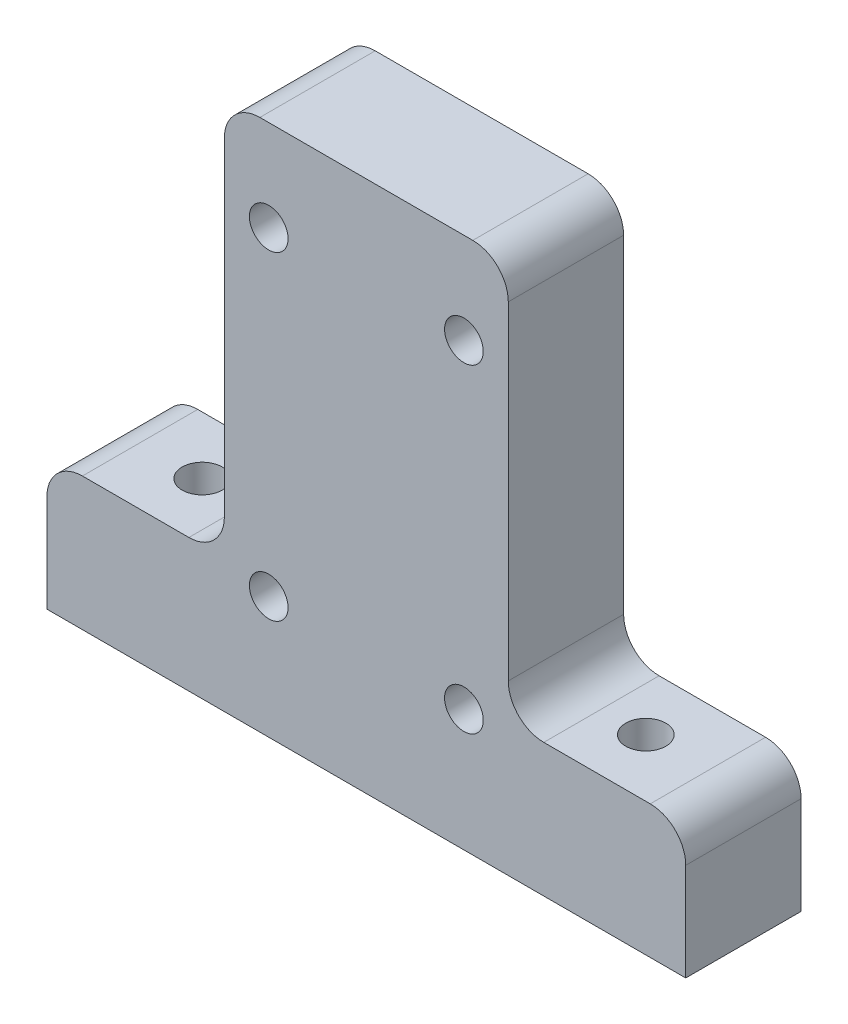
ISO-10303-21;
HEADER;
FILE_DESCRIPTION(('STEP AP214'),'2;1');
FILE_NAME('part.step','',(''),(''),'','','');
FILE_SCHEMA(('AUTOMOTIVE_DESIGN { 1 0 10303 214 1 1 1 1 }'));
ENDSEC;
DATA;
#1=APPLICATION_CONTEXT('core data for automotive mechanical design processes');
#2=APPLICATION_PROTOCOL_DEFINITION('international standard','automotive_design',2000,#1);
#3=PRODUCT_CONTEXT('',#1,'mechanical');
#4=PRODUCT('Part','Part','',(#3));
#5=PRODUCT_RELATED_PRODUCT_CATEGORY('part','',(#4));
#6=PRODUCT_DEFINITION_FORMATION('','',#4);
#7=PRODUCT_DEFINITION_CONTEXT('part definition',#1,'design');
#8=PRODUCT_DEFINITION('design','',#6,#7);
#9=PRODUCT_DEFINITION_SHAPE('','',#8);
#10=(LENGTH_UNIT() NAMED_UNIT(*) SI_UNIT(.MILLI.,.METRE.));
#11=(NAMED_UNIT(*) PLANE_ANGLE_UNIT() SI_UNIT($,.RADIAN.));
#12=(NAMED_UNIT(*) SI_UNIT($,.STERADIAN.) SOLID_ANGLE_UNIT());
#13=UNCERTAINTY_MEASURE_WITH_UNIT(LENGTH_MEASURE(1.E-05),#10,'distance_accuracy_value','');
#14=(GEOMETRIC_REPRESENTATION_CONTEXT(3) GLOBAL_UNCERTAINTY_ASSIGNED_CONTEXT((#13)) GLOBAL_UNIT_ASSIGNED_CONTEXT((#10,
#11,#12)) REPRESENTATION_CONTEXT('',''));
#15=CARTESIAN_POINT('',(0.,0.,0.));
#16=DIRECTION('',(0.,0.,1.));
#17=DIRECTION('',(1.,0.,0.));
#18=AXIS2_PLACEMENT_3D('',#15,#16,#17);
#19=CARTESIAN_POINT('',(0.,0.,6.5));
#20=DIRECTION('',(1.,0.,0.));
#21=DIRECTION('',(0.,0.,-1.));
#22=AXIS2_PLACEMENT_3D('',#19,#20,#21);
#23=PLANE('',#22);
#24=DIRECTION('',(0.,-1.,0.));
#25=VECTOR('',#24,1.);
#26=CARTESIAN_POINT('',(0.,0.,0.));
#27=LINE('',#26,#25);
#28=CARTESIAN_POINT('',(0.,28.,0.));
#29=VERTEX_POINT('',#28);
#30=CARTESIAN_POINT('',(0.,9.5,0.));
#31=VERTEX_POINT('',#30);
#32=EDGE_CURVE('E202',#29,#31,#27,.T.);
#33=ORIENTED_EDGE('',*,*,#32,.T.);
#34=DIRECTION('',(0.,0.,1.));
#35=VECTOR('',#34,1.);
#36=CARTESIAN_POINT('',(0.,9.5,6.5));
#37=LINE('',#36,#35);
#38=CARTESIAN_POINT('',(0.,9.5,6.5));
#39=VERTEX_POINT('',#38);
#40=EDGE_CURVE('E244',#31,#39,#37,.T.);
#41=ORIENTED_EDGE('',*,*,#40,.T.);
#42=DIRECTION('',(0.,-1.,0.));
#43=VECTOR('',#42,1.);
#44=CARTESIAN_POINT('',(0.,0.,6.5));
#45=LINE('',#44,#43);
#46=CARTESIAN_POINT('',(0.,28.,6.5));
#47=VERTEX_POINT('',#46);
#48=EDGE_CURVE('E143',#47,#39,#45,.T.);
#49=ORIENTED_EDGE('',*,*,#48,.F.);
#50=DIRECTION('',(0.,0.,-1.));
#51=VECTOR('',#50,1.);
#52=CARTESIAN_POINT('',(0.,28.,6.5));
#53=LINE('',#52,#51);
#54=EDGE_CURVE('E236',#47,#29,#53,.T.);
#55=ORIENTED_EDGE('',*,*,#54,.T.);
#56=EDGE_LOOP('',(#33,#41,#49,#55));
#57=FACE_BOUND('',#56,.T.);
#58=ADVANCED_FACE('F33',(#57),#23,.F.);
#59=CARTESIAN_POINT('',(0.,0.,6.5));
#60=DIRECTION('',(0.,1.,0.));
#61=DIRECTION('',(0.,0.,1.));
#62=AXIS2_PLACEMENT_3D('',#59,#60,#61);
#63=PLANE('',#62);
#64=CARTESIAN_POINT('',(-4.49999999999999,0.,3.25));
#65=DIRECTION('',(0.,-1.,0.));
#66=DIRECTION('',(0.,0.,-1.));
#67=AXIS2_PLACEMENT_3D('',#64,#65,#66);
#68=CIRCLE('',#67,1.13);
#69=CARTESIAN_POINT('',(-4.49999999999999,0.,2.12));
#70=VERTEX_POINT('',#69);
#71=EDGE_CURVE('E276',#70,#70,#68,.T.);
#72=ORIENTED_EDGE('',*,*,#71,.F.);
#73=EDGE_LOOP('',(#72));
#74=FACE_BOUND('',#73,.T.);
#75=CARTESIAN_POINT('',(20.5,0.,3.25));
#76=DIRECTION('',(0.,-1.,0.));
#77=DIRECTION('',(0.,0.,-1.));
#78=AXIS2_PLACEMENT_3D('',#75,#76,#77);
#79=CIRCLE('',#78,1.13);
#80=CARTESIAN_POINT('',(20.5,0.,2.12));
#81=VERTEX_POINT('',#80);
#82=EDGE_CURVE('E164',#81,#81,#79,.T.);
#83=ORIENTED_EDGE('',*,*,#82,.F.);
#84=EDGE_LOOP('',(#83));
#85=FACE_BOUND('',#84,.T.);
#86=DIRECTION('',(1.,0.,0.));
#87=VECTOR('',#86,1.);
#88=CARTESIAN_POINT('',(0.,0.,0.));
#89=LINE('',#88,#87);
#90=CARTESIAN_POINT('',(-10.,0.,0.));
#91=VERTEX_POINT('',#90);
#92=CARTESIAN_POINT('',(26.,0.,0.));
#93=VERTEX_POINT('',#92);
#94=EDGE_CURVE('E149',#91,#93,#89,.T.);
#95=ORIENTED_EDGE('',*,*,#94,.T.);
#96=DIRECTION('',(0.,0.,1.));
#97=VECTOR('',#96,1.);
#98=CARTESIAN_POINT('',(26.,0.,-12.5));
#99=LINE('',#98,#97);
#100=CARTESIAN_POINT('',(26.,0.,6.5));
#101=VERTEX_POINT('',#100);
#102=EDGE_CURVE('E146',#93,#101,#99,.T.);
#103=ORIENTED_EDGE('',*,*,#102,.T.);
#104=DIRECTION('',(1.,0.,0.));
#105=VECTOR('',#104,1.);
#106=CARTESIAN_POINT('',(0.,0.,6.5));
#107=LINE('',#106,#105);
#108=CARTESIAN_POINT('',(-10.,0.,6.5));
#109=VERTEX_POINT('',#108);
#110=EDGE_CURVE('E133',#109,#101,#107,.T.);
#111=ORIENTED_EDGE('',*,*,#110,.F.);
#112=DIRECTION('',(0.,0.,1.));
#113=VECTOR('',#112,1.);
#114=CARTESIAN_POINT('',(-10.,0.,-12.5));
#115=LINE('',#114,#113);
#116=EDGE_CURVE('E178',#91,#109,#115,.T.);
#117=ORIENTED_EDGE('',*,*,#116,.F.);
#118=EDGE_LOOP('',(#95,#103,#111,#117));
#119=FACE_BOUND('',#118,.T.);
#120=ADVANCED_FACE('F147',(#74,#85,#119),#63,.F.);
#121=CARTESIAN_POINT('',(16.,0.,6.5));
#122=DIRECTION('',(-1.,0.,0.));
#123=DIRECTION('',(0.,-1.,0.));
#124=AXIS2_PLACEMENT_3D('',#121,#122,#123);
#125=PLANE('',#124);
#126=DIRECTION('',(0.,1.,0.));
#127=VECTOR('',#126,1.);
#128=CARTESIAN_POINT('',(16.,0.,6.5));
#129=LINE('',#128,#127);
#130=CARTESIAN_POINT('',(16.,9.5,6.5));
#131=VERTEX_POINT('',#130);
#132=CARTESIAN_POINT('',(16.,28.,6.5));
#133=VERTEX_POINT('',#132);
#134=EDGE_CURVE('E142',#131,#133,#129,.T.);
#135=ORIENTED_EDGE('',*,*,#134,.F.);
#136=DIRECTION('',(0.,0.,1.));
#137=VECTOR('',#136,1.);
#138=CARTESIAN_POINT('',(16.,9.5,6.5));
#139=LINE('',#138,#137);
#140=CARTESIAN_POINT('',(16.,9.5,0.));
#141=VERTEX_POINT('',#140);
#142=EDGE_CURVE('E242',#131,#141,#139,.F.);
#143=ORIENTED_EDGE('',*,*,#142,.T.);
#144=DIRECTION('',(0.,1.,0.));
#145=VECTOR('',#144,1.);
#146=CARTESIAN_POINT('',(16.,0.,0.));
#147=LINE('',#146,#145);
#148=CARTESIAN_POINT('',(16.,28.,0.));
#149=VERTEX_POINT('',#148);
#150=EDGE_CURVE('E216',#141,#149,#147,.T.);
#151=ORIENTED_EDGE('',*,*,#150,.T.);
#152=DIRECTION('',(0.,0.,-1.));
#153=VECTOR('',#152,1.);
#154=CARTESIAN_POINT('',(16.,28.,6.5));
#155=LINE('',#154,#153);
#156=EDGE_CURVE('E229',#149,#133,#155,.F.);
#157=ORIENTED_EDGE('',*,*,#156,.T.);
#158=EDGE_LOOP('',(#135,#143,#151,#157));
#159=FACE_BOUND('',#158,.T.);
#160=ADVANCED_FACE('F286',(#159),#125,.F.);
#161=CARTESIAN_POINT('',(0.,30.,6.5));
#162=DIRECTION('',(0.,-1.,0.));
#163=DIRECTION('',(0.,0.,-1.));
#164=AXIS2_PLACEMENT_3D('',#161,#162,#163);
#165=PLANE('',#164);
#166=DIRECTION('',(-1.,0.,0.));
#167=VECTOR('',#166,1.);
#168=CARTESIAN_POINT('',(0.,30.,6.5));
#169=LINE('',#168,#167);
#170=CARTESIAN_POINT('',(14.,30.,6.5));
#171=VERTEX_POINT('',#170);
#172=CARTESIAN_POINT('',(2.,30.,6.5));
#173=VERTEX_POINT('',#172);
#174=EDGE_CURVE('E209',#171,#173,#169,.T.);
#175=ORIENTED_EDGE('',*,*,#174,.F.);
#176=DIRECTION('',(0.,0.,-1.));
#177=VECTOR('',#176,1.);
#178=CARTESIAN_POINT('',(14.,30.,6.5));
#179=LINE('',#178,#177);
#180=CARTESIAN_POINT('',(14.,30.,0.));
#181=VERTEX_POINT('',#180);
#182=EDGE_CURVE('E221',#171,#181,#179,.T.);
#183=ORIENTED_EDGE('',*,*,#182,.T.);
#184=DIRECTION('',(-1.,0.,0.));
#185=VECTOR('',#184,1.);
#186=CARTESIAN_POINT('',(0.,30.,0.));
#187=LINE('',#186,#185);
#188=CARTESIAN_POINT('',(2.,30.,0.));
#189=VERTEX_POINT('',#188);
#190=EDGE_CURVE('E206',#181,#189,#187,.T.);
#191=ORIENTED_EDGE('',*,*,#190,.T.);
#192=DIRECTION('',(0.,0.,-1.));
#193=VECTOR('',#192,1.);
#194=CARTESIAN_POINT('',(2.,30.,6.5));
#195=LINE('',#194,#193);
#196=EDGE_CURVE('E212',#189,#173,#195,.F.);
#197=ORIENTED_EDGE('',*,*,#196,.T.);
#198=EDGE_LOOP('',(#175,#183,#191,#197));
#199=FACE_BOUND('',#198,.T.);
#200=ADVANCED_FACE('F292',(#199),#165,.F.);
#201=CARTESIAN_POINT('',(0.,0.,6.5));
#202=DIRECTION('',(0.,0.,-1.));
#203=DIRECTION('',(-1.,0.,0.));
#204=AXIS2_PLACEMENT_3D('',#201,#202,#203);
#205=PLANE('',#204);
#206=CARTESIAN_POINT('',(2.50000000000001,6.87,6.5));
#207=DIRECTION('',(0.,0.,-1.));
#208=DIRECTION('',(-1.,0.,0.));
#209=AXIS2_PLACEMENT_3D('',#206,#207,#208);
#210=CIRCLE('',#209,1.09);
#211=CARTESIAN_POINT('',(1.41000000000001,6.87,6.5));
#212=VERTEX_POINT('',#211);
#213=EDGE_CURVE('E181',#212,#212,#210,.T.);
#214=ORIENTED_EDGE('',*,*,#213,.T.);
#215=EDGE_LOOP('',(#214));
#216=FACE_BOUND('',#215,.T.);
#217=CARTESIAN_POINT('',(2.50000000000001,24.87,6.5));
#218=DIRECTION('',(0.,0.,-1.));
#219=DIRECTION('',(-1.,0.,0.));
#220=AXIS2_PLACEMENT_3D('',#217,#218,#219);
#221=CIRCLE('',#220,1.09);
#222=CARTESIAN_POINT('',(1.41000000000001,24.87,6.5));
#223=VERTEX_POINT('',#222);
#224=EDGE_CURVE('E188',#223,#223,#221,.T.);
#225=ORIENTED_EDGE('',*,*,#224,.T.);
#226=EDGE_LOOP('',(#225));
#227=FACE_BOUND('',#226,.T.);
#228=CARTESIAN_POINT('',(13.5,24.87,6.5));
#229=DIRECTION('',(0.,0.,-1.));
#230=DIRECTION('',(-1.,0.,0.));
#231=AXIS2_PLACEMENT_3D('',#228,#229,#230);
#232=CIRCLE('',#231,1.09);
#233=CARTESIAN_POINT('',(12.41,24.87,6.5));
#234=VERTEX_POINT('',#233);
#235=EDGE_CURVE('E194',#234,#234,#232,.T.);
#236=ORIENTED_EDGE('',*,*,#235,.T.);
#237=EDGE_LOOP('',(#236));
#238=FACE_BOUND('',#237,.T.);
#239=CARTESIAN_POINT('',(13.5,6.87,6.5));
#240=DIRECTION('',(0.,0.,-1.));
#241=DIRECTION('',(-1.,0.,0.));
#242=AXIS2_PLACEMENT_3D('',#239,#240,#241);
#243=CIRCLE('',#242,1.09);
#244=CARTESIAN_POINT('',(12.41,6.87,6.5));
#245=VERTEX_POINT('',#244);
#246=EDGE_CURVE('E199',#245,#245,#243,.T.);
#247=ORIENTED_EDGE('',*,*,#246,.T.);
#248=EDGE_LOOP('',(#247));
#249=FACE_BOUND('',#248,.T.);
#250=DIRECTION('',(-1.,0.,0.));
#251=VECTOR('',#250,1.);
#252=CARTESIAN_POINT('',(0.,7.5,6.5));
#253=LINE('',#252,#251);
#254=CARTESIAN_POINT('',(-2.,7.5,6.5));
#255=VERTEX_POINT('',#254);
#256=CARTESIAN_POINT('',(-8.,7.5,6.5));
#257=VERTEX_POINT('',#256);
#258=EDGE_CURVE('E169',#255,#257,#253,.T.);
#259=ORIENTED_EDGE('',*,*,#258,.T.);
#260=CARTESIAN_POINT('',(-8.,5.5,6.5));
#261=DIRECTION('',(0.,0.,-1.));
#262=DIRECTION('',(-1.,0.,0.));
#263=AXIS2_PLACEMENT_3D('',#260,#261,#262);
#264=CIRCLE('',#263,2.);
#265=CARTESIAN_POINT('',(-10.,5.5,6.5));
#266=VERTEX_POINT('',#265);
#267=EDGE_CURVE('E57',#257,#266,#264,.F.);
#268=ORIENTED_EDGE('',*,*,#267,.T.);
#269=DIRECTION('',(0.,-1.,0.));
#270=VECTOR('',#269,1.);
#271=CARTESIAN_POINT('',(-10.,7.5,6.5));
#272=LINE('',#271,#270);
#273=EDGE_CURVE('E138',#266,#109,#272,.T.);
#274=ORIENTED_EDGE('',*,*,#273,.T.);
#275=ORIENTED_EDGE('',*,*,#110,.T.);
#276=DIRECTION('',(0.,1.,0.));
#277=VECTOR('',#276,1.);
#278=CARTESIAN_POINT('',(26.,7.5,6.5));
#279=LINE('',#278,#277);
#280=CARTESIAN_POINT('',(26.,5.5,6.5));
#281=VERTEX_POINT('',#280);
#282=EDGE_CURVE('E137',#101,#281,#279,.T.);
#283=ORIENTED_EDGE('',*,*,#282,.T.);
#284=CARTESIAN_POINT('',(24.,5.5,6.5));
#285=DIRECTION('',(0.,0.,-1.));
#286=DIRECTION('',(-1.,0.,0.));
#287=AXIS2_PLACEMENT_3D('',#284,#285,#286);
#288=CIRCLE('',#287,2.);
#289=CARTESIAN_POINT('',(24.,7.5,6.5));
#290=VERTEX_POINT('',#289);
#291=EDGE_CURVE('E259',#281,#290,#288,.F.);
#292=ORIENTED_EDGE('',*,*,#291,.T.);
#293=DIRECTION('',(-1.,0.,0.));
#294=VECTOR('',#293,1.);
#295=CARTESIAN_POINT('',(16.,7.5,6.5));
#296=LINE('',#295,#294);
#297=CARTESIAN_POINT('',(18.,7.5,6.5));
#298=VERTEX_POINT('',#297);
#299=EDGE_CURVE('E159',#290,#298,#296,.T.);
#300=ORIENTED_EDGE('',*,*,#299,.T.);
#301=CARTESIAN_POINT('',(18.,9.5,6.5));
#302=DIRECTION('',(0.,0.,-1.));
#303=DIRECTION('',(-1.,0.,0.));
#304=AXIS2_PLACEMENT_3D('',#301,#302,#303);
#305=CIRCLE('',#304,2.);
#306=EDGE_CURVE('E249',#298,#131,#305,.T.);
#307=ORIENTED_EDGE('',*,*,#306,.T.);
#308=ORIENTED_EDGE('',*,*,#134,.T.);
#309=CARTESIAN_POINT('',(14.,28.,6.5));
#310=DIRECTION('',(0.,0.,-1.));
#311=DIRECTION('',(-1.,0.,0.));
#312=AXIS2_PLACEMENT_3D('',#309,#310,#311);
#313=CIRCLE('',#312,2.);
#314=EDGE_CURVE('E234',#133,#171,#313,.F.);
#315=ORIENTED_EDGE('',*,*,#314,.T.);
#316=ORIENTED_EDGE('',*,*,#174,.T.);
#317=CARTESIAN_POINT('',(2.,28.,6.5));
#318=DIRECTION('',(0.,0.,-1.));
#319=DIRECTION('',(-1.,0.,0.));
#320=AXIS2_PLACEMENT_3D('',#317,#318,#319);
#321=CIRCLE('',#320,2.);
#322=EDGE_CURVE('E232',#173,#47,#321,.F.);
#323=ORIENTED_EDGE('',*,*,#322,.T.);
#324=ORIENTED_EDGE('',*,*,#48,.T.);
#325=CARTESIAN_POINT('',(-2.,9.5,6.5));
#326=DIRECTION('',(0.,0.,-1.));
#327=DIRECTION('',(-1.,0.,0.));
#328=AXIS2_PLACEMENT_3D('',#325,#326,#327);
#329=CIRCLE('',#328,2.);
#330=EDGE_CURVE('E254',#39,#255,#329,.T.);
#331=ORIENTED_EDGE('',*,*,#330,.T.);
#332=EDGE_LOOP('',(#259,#268,#274,#275,#283,#292,#300,#307,#308,#315,#316,#323,#324,#331));
#333=FACE_BOUND('',#332,.T.);
#334=ADVANCED_FACE('F135',(#216,#227,#238,#249,#333),#205,.F.);
#335=CARTESIAN_POINT('',(0.,0.,0.));
#336=DIRECTION('',(0.,0.,-1.));
#337=DIRECTION('',(-1.,0.,0.));
#338=AXIS2_PLACEMENT_3D('',#335,#336,#337);
#339=PLANE('',#338);
#340=CARTESIAN_POINT('',(2.50000000000001,6.87,0.));
#341=DIRECTION('',(0.,0.,-1.));
#342=DIRECTION('',(-1.,0.,0.));
#343=AXIS2_PLACEMENT_3D('',#340,#341,#342);
#344=CIRCLE('',#343,1.09);
#345=CARTESIAN_POINT('',(1.41000000000001,6.87,0.));
#346=VERTEX_POINT('',#345);
#347=EDGE_CURVE('E185',#346,#346,#344,.T.);
#348=ORIENTED_EDGE('',*,*,#347,.F.);
#349=EDGE_LOOP('',(#348));
#350=FACE_BOUND('',#349,.T.);
#351=CARTESIAN_POINT('',(2.50000000000001,24.87,0.));
#352=DIRECTION('',(0.,0.,-1.));
#353=DIRECTION('',(-1.,0.,0.));
#354=AXIS2_PLACEMENT_3D('',#351,#352,#353);
#355=CIRCLE('',#354,1.09);
#356=CARTESIAN_POINT('',(1.41000000000001,24.87,0.));
#357=VERTEX_POINT('',#356);
#358=EDGE_CURVE('E191',#357,#357,#355,.T.);
#359=ORIENTED_EDGE('',*,*,#358,.F.);
#360=EDGE_LOOP('',(#359));
#361=FACE_BOUND('',#360,.T.);
#362=CARTESIAN_POINT('',(13.5,24.87,0.));
#363=DIRECTION('',(0.,0.,-1.));
#364=DIRECTION('',(-1.,0.,0.));
#365=AXIS2_PLACEMENT_3D('',#362,#363,#364);
#366=CIRCLE('',#365,1.09);
#367=CARTESIAN_POINT('',(12.41,24.87,0.));
#368=VERTEX_POINT('',#367);
#369=EDGE_CURVE('E180',#368,#368,#366,.T.);
#370=ORIENTED_EDGE('',*,*,#369,.F.);
#371=EDGE_LOOP('',(#370));
#372=FACE_BOUND('',#371,.T.);
#373=CARTESIAN_POINT('',(13.5,6.87,0.));
#374=DIRECTION('',(0.,0.,-1.));
#375=DIRECTION('',(-1.,0.,0.));
#376=AXIS2_PLACEMENT_3D('',#373,#374,#375);
#377=CIRCLE('',#376,1.09);
#378=CARTESIAN_POINT('',(12.41,6.87,0.));
#379=VERTEX_POINT('',#378);
#380=EDGE_CURVE('E184',#379,#379,#377,.T.);
#381=ORIENTED_EDGE('',*,*,#380,.F.);
#382=EDGE_LOOP('',(#381));
#383=FACE_BOUND('',#382,.T.);
#384=DIRECTION('',(0.,-1.,0.));
#385=VECTOR('',#384,1.);
#386=CARTESIAN_POINT('',(-10.,7.5,0.));
#387=LINE('',#386,#385);
#388=CARTESIAN_POINT('',(-10.,5.5,0.));
#389=VERTEX_POINT('',#388);
#390=EDGE_CURVE('E176',#389,#91,#387,.T.);
#391=ORIENTED_EDGE('',*,*,#390,.F.);
#392=CARTESIAN_POINT('',(-8.,5.5,0.));
#393=DIRECTION('',(0.,0.,-1.));
#394=DIRECTION('',(-1.,0.,0.));
#395=AXIS2_PLACEMENT_3D('',#392,#393,#394);
#396=CIRCLE('',#395,2.);
#397=CARTESIAN_POINT('',(-8.,7.5,0.));
#398=VERTEX_POINT('',#397);
#399=EDGE_CURVE('E11',#389,#398,#396,.T.);
#400=ORIENTED_EDGE('',*,*,#399,.T.);
#401=DIRECTION('',(-1.,0.,0.));
#402=VECTOR('',#401,1.);
#403=CARTESIAN_POINT('',(0.,7.5,0.));
#404=LINE('',#403,#402);
#405=CARTESIAN_POINT('',(-2.,7.5,0.));
#406=VERTEX_POINT('',#405);
#407=EDGE_CURVE('E172',#406,#398,#404,.T.);
#408=ORIENTED_EDGE('',*,*,#407,.F.);
#409=CARTESIAN_POINT('',(-2.,9.5,0.));
#410=DIRECTION('',(0.,0.,-1.));
#411=DIRECTION('',(-1.,0.,0.));
#412=AXIS2_PLACEMENT_3D('',#409,#410,#411);
#413=CIRCLE('',#412,2.);
#414=EDGE_CURVE('E256',#406,#31,#413,.F.);
#415=ORIENTED_EDGE('',*,*,#414,.T.);
#416=ORIENTED_EDGE('',*,*,#32,.F.);
#417=CARTESIAN_POINT('',(2.,28.,0.));
#418=DIRECTION('',(0.,0.,-1.));
#419=DIRECTION('',(-1.,0.,0.));
#420=AXIS2_PLACEMENT_3D('',#417,#418,#419);
#421=CIRCLE('',#420,2.);
#422=EDGE_CURVE('E224',#29,#189,#421,.T.);
#423=ORIENTED_EDGE('',*,*,#422,.T.);
#424=ORIENTED_EDGE('',*,*,#190,.F.);
#425=CARTESIAN_POINT('',(14.,28.,0.));
#426=DIRECTION('',(0.,0.,-1.));
#427=DIRECTION('',(-1.,0.,0.));
#428=AXIS2_PLACEMENT_3D('',#425,#426,#427);
#429=CIRCLE('',#428,2.);
#430=EDGE_CURVE('E226',#181,#149,#429,.T.);
#431=ORIENTED_EDGE('',*,*,#430,.T.);
#432=ORIENTED_EDGE('',*,*,#150,.F.);
#433=CARTESIAN_POINT('',(18.,9.5,0.));
#434=DIRECTION('',(0.,0.,-1.));
#435=DIRECTION('',(-1.,0.,0.));
#436=AXIS2_PLACEMENT_3D('',#433,#434,#435);
#437=CIRCLE('',#436,2.);
#438=CARTESIAN_POINT('',(18.,7.5,0.));
#439=VERTEX_POINT('',#438);
#440=EDGE_CURVE('E251',#141,#439,#437,.F.);
#441=ORIENTED_EDGE('',*,*,#440,.T.);
#442=DIRECTION('',(-1.,0.,0.));
#443=VECTOR('',#442,1.);
#444=CARTESIAN_POINT('',(16.,7.5,0.));
#445=LINE('',#444,#443);
#446=CARTESIAN_POINT('',(24.,7.5,0.));
#447=VERTEX_POINT('',#446);
#448=EDGE_CURVE('E167',#447,#439,#445,.T.);
#449=ORIENTED_EDGE('',*,*,#448,.F.);
#450=CARTESIAN_POINT('',(24.,5.5,0.));
#451=DIRECTION('',(0.,0.,-1.));
#452=DIRECTION('',(-1.,0.,0.));
#453=AXIS2_PLACEMENT_3D('',#450,#451,#452);
#454=CIRCLE('',#453,2.);
#455=CARTESIAN_POINT('',(26.,5.5,0.));
#456=VERTEX_POINT('',#455);
#457=EDGE_CURVE('E263',#447,#456,#454,.T.);
#458=ORIENTED_EDGE('',*,*,#457,.T.);
#459=DIRECTION('',(0.,1.,0.));
#460=VECTOR('',#459,1.);
#461=CARTESIAN_POINT('',(26.,7.5,0.));
#462=LINE('',#461,#460);
#463=EDGE_CURVE('E153',#93,#456,#462,.T.);
#464=ORIENTED_EDGE('',*,*,#463,.F.);
#465=ORIENTED_EDGE('',*,*,#94,.F.);
#466=EDGE_LOOP('',(#391,#400,#408,#415,#416,#423,#424,#431,#432,#441,#449,#458,#464,#465));
#467=FACE_BOUND('',#466,.T.);
#468=ADVANCED_FACE('F329',(#350,#361,#372,#383,#467),#339,.T.);
#469=CARTESIAN_POINT('',(13.5,6.87,6.5));
#470=DIRECTION('',(0.,0.,-1.));
#471=DIRECTION('',(-1.,0.,0.));
#472=AXIS2_PLACEMENT_3D('',#469,#470,#471);
#473=CYLINDRICAL_SURFACE('',#472,1.09);
#474=ORIENTED_EDGE('',*,*,#246,.F.);
#475=EDGE_LOOP('',(#474));
#476=FACE_BOUND('',#475,.T.);
#477=ORIENTED_EDGE('',*,*,#380,.T.);
#478=EDGE_LOOP('',(#477));
#479=FACE_BOUND('',#478,.T.);
#480=ADVANCED_FACE('F379',(#476,#479),#473,.F.);
#481=CARTESIAN_POINT('',(13.5,24.87,6.5));
#482=DIRECTION('',(0.,0.,-1.));
#483=DIRECTION('',(-1.,0.,0.));
#484=AXIS2_PLACEMENT_3D('',#481,#482,#483);
#485=CYLINDRICAL_SURFACE('',#484,1.09);
#486=ORIENTED_EDGE('',*,*,#235,.F.);
#487=EDGE_LOOP('',(#486));
#488=FACE_BOUND('',#487,.T.);
#489=ORIENTED_EDGE('',*,*,#369,.T.);
#490=EDGE_LOOP('',(#489));
#491=FACE_BOUND('',#490,.T.);
#492=ADVANCED_FACE('F375',(#488,#491),#485,.F.);
#493=CARTESIAN_POINT('',(2.50000000000001,24.87,6.5));
#494=DIRECTION('',(0.,0.,-1.));
#495=DIRECTION('',(-1.,0.,0.));
#496=AXIS2_PLACEMENT_3D('',#493,#494,#495);
#497=CYLINDRICAL_SURFACE('',#496,1.09);
#498=ORIENTED_EDGE('',*,*,#224,.F.);
#499=EDGE_LOOP('',(#498));
#500=FACE_BOUND('',#499,.T.);
#501=ORIENTED_EDGE('',*,*,#358,.T.);
#502=EDGE_LOOP('',(#501));
#503=FACE_BOUND('',#502,.T.);
#504=ADVANCED_FACE('F371',(#500,#503),#497,.F.);
#505=CARTESIAN_POINT('',(2.50000000000001,6.87,6.5));
#506=DIRECTION('',(0.,0.,-1.));
#507=DIRECTION('',(-1.,0.,0.));
#508=AXIS2_PLACEMENT_3D('',#505,#506,#507);
#509=CYLINDRICAL_SURFACE('',#508,1.09);
#510=ORIENTED_EDGE('',*,*,#213,.F.);
#511=EDGE_LOOP('',(#510));
#512=FACE_BOUND('',#511,.T.);
#513=ORIENTED_EDGE('',*,*,#347,.T.);
#514=EDGE_LOOP('',(#513));
#515=FACE_BOUND('',#514,.T.);
#516=ADVANCED_FACE('F303',(#512,#515),#509,.F.);
#517=CARTESIAN_POINT('',(14.,28.,6.5));
#518=DIRECTION('',(0.,0.,-1.));
#519=DIRECTION('',(-1.,0.,0.));
#520=AXIS2_PLACEMENT_3D('',#517,#518,#519);
#521=CYLINDRICAL_SURFACE('',#520,2.);
#522=ORIENTED_EDGE('',*,*,#314,.F.);
#523=ORIENTED_EDGE('',*,*,#156,.F.);
#524=ORIENTED_EDGE('',*,*,#430,.F.);
#525=ORIENTED_EDGE('',*,*,#182,.F.);
#526=EDGE_LOOP('',(#522,#523,#524,#525));
#527=FACE_BOUND('',#526,.T.);
#528=ADVANCED_FACE('F299',(#527),#521,.T.);
#529=CARTESIAN_POINT('',(2.,28.,6.5));
#530=DIRECTION('',(0.,0.,-1.));
#531=DIRECTION('',(-1.,0.,0.));
#532=AXIS2_PLACEMENT_3D('',#529,#530,#531);
#533=CYLINDRICAL_SURFACE('',#532,2.);
#534=ORIENTED_EDGE('',*,*,#322,.F.);
#535=ORIENTED_EDGE('',*,*,#196,.F.);
#536=ORIENTED_EDGE('',*,*,#422,.F.);
#537=ORIENTED_EDGE('',*,*,#54,.F.);
#538=EDGE_LOOP('',(#534,#535,#536,#537));
#539=FACE_BOUND('',#538,.T.);
#540=ADVANCED_FACE('F302',(#539),#533,.T.);
#541=CARTESIAN_POINT('',(0.,7.5,-12.5));
#542=DIRECTION('',(0.,1.,0.));
#543=DIRECTION('',(-1.,0.,0.));
#544=AXIS2_PLACEMENT_3D('',#541,#542,#543);
#545=PLANE('',#544);
#546=CARTESIAN_POINT('',(-4.49999999999999,7.5,3.25));
#547=DIRECTION('',(0.,1.,0.));
#548=DIRECTION('',(-1.,0.,0.));
#549=AXIS2_PLACEMENT_3D('',#546,#547,#548);
#550=CIRCLE('',#549,1.13);
#551=CARTESIAN_POINT('',(-5.62999999999999,7.5,3.25));
#552=VERTEX_POINT('',#551);
#553=EDGE_CURVE('E37',#552,#552,#550,.T.);
#554=ORIENTED_EDGE('',*,*,#553,.F.);
#555=EDGE_LOOP('',(#554));
#556=FACE_BOUND('',#555,.T.);
#557=ORIENTED_EDGE('',*,*,#407,.T.);
#558=DIRECTION('',(0.,0.,1.));
#559=VECTOR('',#558,1.);
#560=CARTESIAN_POINT('',(-8.,7.5,-12.5));
#561=LINE('',#560,#559);
#562=EDGE_CURVE('E265',#398,#257,#561,.T.);
#563=ORIENTED_EDGE('',*,*,#562,.T.);
#564=ORIENTED_EDGE('',*,*,#258,.F.);
#565=DIRECTION('',(0.,0.,1.));
#566=VECTOR('',#565,1.);
#567=CARTESIAN_POINT('',(-2.,7.5,-12.5));
#568=LINE('',#567,#566);
#569=EDGE_CURVE('E247',#255,#406,#568,.F.);
#570=ORIENTED_EDGE('',*,*,#569,.T.);
#571=EDGE_LOOP('',(#557,#563,#564,#570));
#572=FACE_BOUND('',#571,.T.);
#573=ADVANCED_FACE('F307',(#556,#572),#545,.T.);
#574=CARTESIAN_POINT('',(-10.,7.5,-12.5));
#575=DIRECTION('',(-1.,0.,0.));
#576=DIRECTION('',(0.,-1.,0.));
#577=AXIS2_PLACEMENT_3D('',#574,#575,#576);
#578=PLANE('',#577);
#579=ORIENTED_EDGE('',*,*,#273,.F.);
#580=DIRECTION('',(0.,0.,1.));
#581=VECTOR('',#580,1.);
#582=CARTESIAN_POINT('',(-10.,5.5,-12.5));
#583=LINE('',#582,#581);
#584=EDGE_CURVE('E42',#266,#389,#583,.F.);
#585=ORIENTED_EDGE('',*,*,#584,.T.);
#586=ORIENTED_EDGE('',*,*,#390,.T.);
#587=ORIENTED_EDGE('',*,*,#116,.T.);
#588=EDGE_LOOP('',(#579,#585,#586,#587));
#589=FACE_BOUND('',#588,.T.);
#590=ADVANCED_FACE('F357',(#589),#578,.T.);
#591=CARTESIAN_POINT('',(26.,7.5,-12.5));
#592=DIRECTION('',(1.,0.,0.));
#593=DIRECTION('',(0.,1.,0.));
#594=AXIS2_PLACEMENT_3D('',#591,#592,#593);
#595=PLANE('',#594);
#596=ORIENTED_EDGE('',*,*,#463,.T.);
#597=DIRECTION('',(0.,0.,1.));
#598=VECTOR('',#597,1.);
#599=CARTESIAN_POINT('',(26.,5.5,-12.5));
#600=LINE('',#599,#598);
#601=EDGE_CURVE('E158',#456,#281,#600,.T.);
#602=ORIENTED_EDGE('',*,*,#601,.T.);
#603=ORIENTED_EDGE('',*,*,#282,.F.);
#604=ORIENTED_EDGE('',*,*,#102,.F.);
#605=EDGE_LOOP('',(#596,#602,#603,#604));
#606=FACE_BOUND('',#605,.T.);
#607=ADVANCED_FACE('F156',(#606),#595,.T.);
#608=CARTESIAN_POINT('',(16.,7.5,-12.5));
#609=DIRECTION('',(0.,1.,0.));
#610=DIRECTION('',(-1.,0.,0.));
#611=AXIS2_PLACEMENT_3D('',#608,#609,#610);
#612=PLANE('',#611);
#613=CARTESIAN_POINT('',(20.5,7.5,3.25));
#614=DIRECTION('',(0.,1.,0.));
#615=DIRECTION('',(-1.,0.,0.));
#616=AXIS2_PLACEMENT_3D('',#613,#614,#615);
#617=CIRCLE('',#616,1.13);
#618=CARTESIAN_POINT('',(19.37,7.5,3.25));
#619=VERTEX_POINT('',#618);
#620=EDGE_CURVE('E161',#619,#619,#617,.T.);
#621=ORIENTED_EDGE('',*,*,#620,.F.);
#622=EDGE_LOOP('',(#621));
#623=FACE_BOUND('',#622,.T.);
#624=ORIENTED_EDGE('',*,*,#299,.F.);
#625=DIRECTION('',(0.,0.,1.));
#626=VECTOR('',#625,1.);
#627=CARTESIAN_POINT('',(24.,7.5,-12.5));
#628=LINE('',#627,#626);
#629=EDGE_CURVE('E261',#290,#447,#628,.F.);
#630=ORIENTED_EDGE('',*,*,#629,.T.);
#631=ORIENTED_EDGE('',*,*,#448,.T.);
#632=DIRECTION('',(0.,0.,1.));
#633=VECTOR('',#632,1.);
#634=CARTESIAN_POINT('',(18.,7.5,-12.5));
#635=LINE('',#634,#633);
#636=EDGE_CURVE('E239',#439,#298,#635,.T.);
#637=ORIENTED_EDGE('',*,*,#636,.T.);
#638=EDGE_LOOP('',(#624,#630,#631,#637));
#639=FACE_BOUND('',#638,.T.);
#640=ADVANCED_FACE('F313',(#623,#639),#612,.T.);
#641=CARTESIAN_POINT('',(18.,9.5,-12.5));
#642=DIRECTION('',(0.,0.,1.));
#643=DIRECTION('',(1.,0.,0.));
#644=AXIS2_PLACEMENT_3D('',#641,#642,#643);
#645=CYLINDRICAL_SURFACE('',#644,2.);
#646=ORIENTED_EDGE('',*,*,#440,.F.);
#647=ORIENTED_EDGE('',*,*,#142,.F.);
#648=ORIENTED_EDGE('',*,*,#306,.F.);
#649=ORIENTED_EDGE('',*,*,#636,.F.);
#650=EDGE_LOOP('',(#646,#647,#648,#649));
#651=FACE_BOUND('',#650,.T.);
#652=ADVANCED_FACE('F309',(#651),#645,.F.);
#653=CARTESIAN_POINT('',(-2.,9.5,6.5));
#654=DIRECTION('',(0.,0.,1.));
#655=DIRECTION('',(1.,0.,0.));
#656=AXIS2_PLACEMENT_3D('',#653,#654,#655);
#657=CYLINDRICAL_SURFACE('',#656,2.);
#658=ORIENTED_EDGE('',*,*,#414,.F.);
#659=ORIENTED_EDGE('',*,*,#569,.F.);
#660=ORIENTED_EDGE('',*,*,#330,.F.);
#661=ORIENTED_EDGE('',*,*,#40,.F.);
#662=EDGE_LOOP('',(#658,#659,#660,#661));
#663=FACE_BOUND('',#662,.T.);
#664=ADVANCED_FACE('F312',(#663),#657,.F.);
#665=CARTESIAN_POINT('',(24.,5.5,-12.5));
#666=DIRECTION('',(0.,0.,1.));
#667=DIRECTION('',(1.,0.,0.));
#668=AXIS2_PLACEMENT_3D('',#665,#666,#667);
#669=CYLINDRICAL_SURFACE('',#668,2.);
#670=ORIENTED_EDGE('',*,*,#457,.F.);
#671=ORIENTED_EDGE('',*,*,#629,.F.);
#672=ORIENTED_EDGE('',*,*,#291,.F.);
#673=ORIENTED_EDGE('',*,*,#601,.F.);
#674=EDGE_LOOP('',(#670,#671,#672,#673));
#675=FACE_BOUND('',#674,.T.);
#676=ADVANCED_FACE('F316',(#675),#669,.T.);
#677=CARTESIAN_POINT('',(-8.,5.5,-12.5));
#678=DIRECTION('',(0.,0.,1.));
#679=DIRECTION('',(1.,0.,0.));
#680=AXIS2_PLACEMENT_3D('',#677,#678,#679);
#681=CYLINDRICAL_SURFACE('',#680,2.);
#682=ORIENTED_EDGE('',*,*,#399,.F.);
#683=ORIENTED_EDGE('',*,*,#584,.F.);
#684=ORIENTED_EDGE('',*,*,#267,.F.);
#685=ORIENTED_EDGE('',*,*,#562,.F.);
#686=EDGE_LOOP('',(#682,#683,#684,#685));
#687=FACE_BOUND('',#686,.T.);
#688=ADVANCED_FACE('F35',(#687),#681,.T.);
#689=CARTESIAN_POINT('',(20.5,30.,3.25));
#690=DIRECTION('',(0.,-1.,0.));
#691=DIRECTION('',(0.,0.,-1.));
#692=AXIS2_PLACEMENT_3D('',#689,#690,#691);
#693=CYLINDRICAL_SURFACE('',#692,1.13);
#694=ORIENTED_EDGE('',*,*,#620,.T.);
#695=EDGE_LOOP('',(#694));
#696=FACE_BOUND('',#695,.T.);
#697=ORIENTED_EDGE('',*,*,#82,.T.);
#698=EDGE_LOOP('',(#697));
#699=FACE_BOUND('',#698,.T.);
#700=ADVANCED_FACE('F323',(#696,#699),#693,.F.);
#701=CARTESIAN_POINT('',(-4.49999999999999,30.,3.25));
#702=DIRECTION('',(0.,-1.,0.));
#703=DIRECTION('',(0.,0.,-1.));
#704=AXIS2_PLACEMENT_3D('',#701,#702,#703);
#705=CYLINDRICAL_SURFACE('',#704,1.13);
#706=ORIENTED_EDGE('',*,*,#553,.T.);
#707=EDGE_LOOP('',(#706));
#708=FACE_BOUND('',#707,.T.);
#709=ORIENTED_EDGE('',*,*,#71,.T.);
#710=EDGE_LOOP('',(#709));
#711=FACE_BOUND('',#710,.T.);
#712=ADVANCED_FACE('F282',(#708,#711),#705,.F.);
#713=CLOSED_SHELL('',(#58,#120,#160,#200,#334,#468,#480,#492,#504,#516,#528,#540,#573,#590,#607,
#640,#652,#664,#676,#688,#700,#712));
#714=MANIFOLD_SOLID_BREP('B2',#713);
#715=ADVANCED_BREP_SHAPE_REPRESENTATION('',(#18,#714),#14);
#716=SHAPE_DEFINITION_REPRESENTATION(#9,#715);
ENDSEC;
END-ISO-10303-21;
